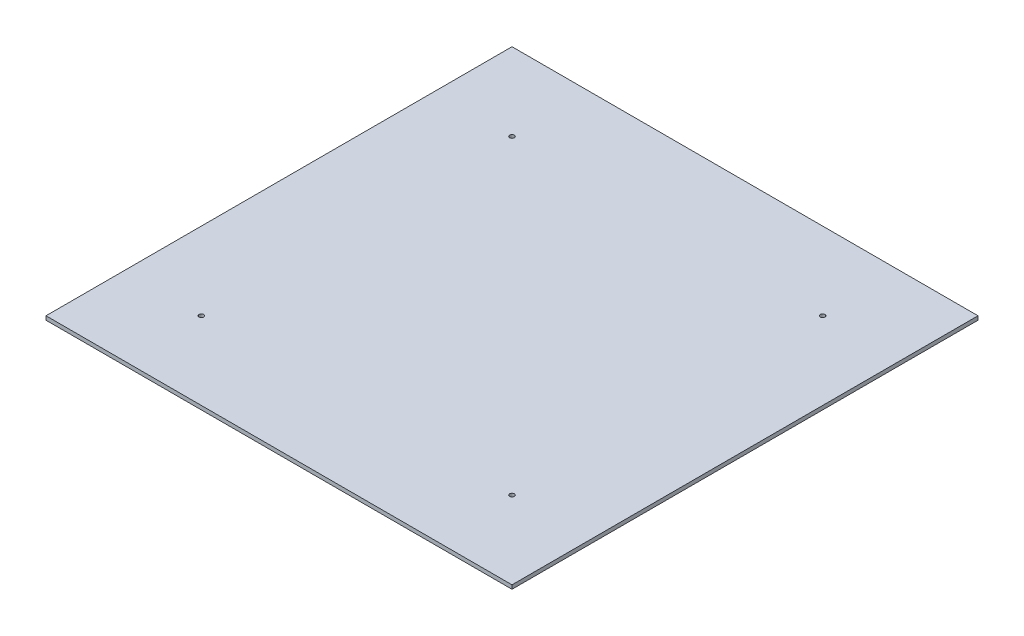
ISO-10303-21;
HEADER;
FILE_DESCRIPTION(('STEP AP214'),'2;1');
FILE_NAME('part.step','',(''),(''),'','','');
FILE_SCHEMA(('AUTOMOTIVE_DESIGN { 1 0 10303 214 1 1 1 1 }'));
ENDSEC;
DATA;
#1=APPLICATION_CONTEXT('core data for automotive mechanical design processes');
#2=APPLICATION_PROTOCOL_DEFINITION('international standard','automotive_design',2000,#1);
#3=PRODUCT_CONTEXT('',#1,'mechanical');
#4=PRODUCT('Part','Part','',(#3));
#5=PRODUCT_RELATED_PRODUCT_CATEGORY('part','',(#4));
#6=PRODUCT_DEFINITION_FORMATION('','',#4);
#7=PRODUCT_DEFINITION_CONTEXT('part definition',#1,'design');
#8=PRODUCT_DEFINITION('design','',#6,#7);
#9=PRODUCT_DEFINITION_SHAPE('','',#8);
#10=(LENGTH_UNIT() NAMED_UNIT(*) SI_UNIT(.MILLI.,.METRE.));
#11=(NAMED_UNIT(*) PLANE_ANGLE_UNIT() SI_UNIT($,.RADIAN.));
#12=(NAMED_UNIT(*) SI_UNIT($,.STERADIAN.) SOLID_ANGLE_UNIT());
#13=UNCERTAINTY_MEASURE_WITH_UNIT(LENGTH_MEASURE(1.E-05),#10,'distance_accuracy_value','');
#14=(GEOMETRIC_REPRESENTATION_CONTEXT(3) GLOBAL_UNCERTAINTY_ASSIGNED_CONTEXT((#13)) GLOBAL_UNIT_ASSIGNED_CONTEXT((#10,
#11,#12)) REPRESENTATION_CONTEXT('',''));
#15=CARTESIAN_POINT('',(0.,0.,0.));
#16=DIRECTION('',(0.,0.,1.));
#17=DIRECTION('',(1.,0.,0.));
#18=AXIS2_PLACEMENT_3D('',#15,#16,#17);
#19=CARTESIAN_POINT('',(0.,2.5,0.));
#20=DIRECTION('',(0.,1.,0.));
#21=DIRECTION('',(0.,0.,1.));
#22=AXIS2_PLACEMENT_3D('',#19,#20,#21);
#23=PLANE('',#22);
#24=CARTESIAN_POINT('',(-100.,2.5,100.));
#25=DIRECTION('',(0.,1.,0.));
#26=DIRECTION('',(0.,0.,-1.));
#27=AXIS2_PLACEMENT_3D('',#24,#25,#26);
#28=CIRCLE('',#27,1.5);
#29=CARTESIAN_POINT('',(-100.,2.5,98.5000000000001));
#30=VERTEX_POINT('',#29);
#31=EDGE_CURVE('E125',#30,#30,#28,.T.);
#32=ORIENTED_EDGE('',*,*,#31,.F.);
#33=EDGE_LOOP('',(#32));
#34=FACE_BOUND('',#33,.T.);
#35=CARTESIAN_POINT('',(-100.,2.5,-100.));
#36=DIRECTION('',(0.,1.,0.));
#37=DIRECTION('',(0.,0.,1.));
#38=AXIS2_PLACEMENT_3D('',#35,#36,#37);
#39=CIRCLE('',#38,1.5);
#40=CARTESIAN_POINT('',(-100.,2.5,-98.5000000000001));
#41=VERTEX_POINT('',#40);
#42=EDGE_CURVE('E104',#41,#41,#39,.T.);
#43=ORIENTED_EDGE('',*,*,#42,.F.);
#44=EDGE_LOOP('',(#43));
#45=FACE_BOUND('',#44,.T.);
#46=DIRECTION('',(0.,0.,-1.));
#47=VECTOR('',#46,1.);
#48=CARTESIAN_POINT('',(150.,2.5,-150.));
#49=LINE('',#48,#47);
#50=CARTESIAN_POINT('',(150.,2.5,150.));
#51=VERTEX_POINT('',#50);
#52=CARTESIAN_POINT('',(150.,2.5,-150.));
#53=VERTEX_POINT('',#52);
#54=EDGE_CURVE('E89',#51,#53,#49,.T.);
#55=ORIENTED_EDGE('',*,*,#54,.T.);
#56=DIRECTION('',(-1.,0.,0.));
#57=VECTOR('',#56,1.);
#58=CARTESIAN_POINT('',(-150.,2.5,-150.));
#59=LINE('',#58,#57);
#60=CARTESIAN_POINT('',(-150.,2.5,-150.));
#61=VERTEX_POINT('',#60);
#62=EDGE_CURVE('E84',#53,#61,#59,.T.);
#63=ORIENTED_EDGE('',*,*,#62,.T.);
#64=DIRECTION('',(0.,0.,1.));
#65=VECTOR('',#64,1.);
#66=CARTESIAN_POINT('',(-150.,2.5,-150.));
#67=LINE('',#66,#65);
#68=CARTESIAN_POINT('',(-150.,2.5,150.));
#69=VERTEX_POINT('',#68);
#70=EDGE_CURVE('E87',#61,#69,#67,.T.);
#71=ORIENTED_EDGE('',*,*,#70,.T.);
#72=DIRECTION('',(1.,0.,0.));
#73=VECTOR('',#72,1.);
#74=CARTESIAN_POINT('',(-150.,2.5,150.));
#75=LINE('',#74,#73);
#76=EDGE_CURVE('E54',#69,#51,#75,.T.);
#77=ORIENTED_EDGE('',*,*,#76,.T.);
#78=EDGE_LOOP('',(#55,#63,#71,#77));
#79=FACE_BOUND('',#78,.T.);
#80=CARTESIAN_POINT('',(100.,2.5,-100.));
#81=DIRECTION('',(0.,1.,0.));
#82=DIRECTION('',(0.,0.,-1.));
#83=AXIS2_PLACEMENT_3D('',#80,#81,#82);
#84=CIRCLE('',#83,1.5);
#85=CARTESIAN_POINT('',(100.,2.5,-101.5));
#86=VERTEX_POINT('',#85);
#87=EDGE_CURVE('E119',#86,#86,#84,.T.);
#88=ORIENTED_EDGE('',*,*,#87,.F.);
#89=EDGE_LOOP('',(#88));
#90=FACE_BOUND('',#89,.T.);
#91=CARTESIAN_POINT('',(100.,2.5,100.));
#92=DIRECTION('',(0.,1.,0.));
#93=DIRECTION('',(0.,0.,1.));
#94=AXIS2_PLACEMENT_3D('',#91,#92,#93);
#95=CIRCLE('',#94,1.5);
#96=CARTESIAN_POINT('',(100.,2.5,101.5));
#97=VERTEX_POINT('',#96);
#98=EDGE_CURVE('E131',#97,#97,#95,.T.);
#99=ORIENTED_EDGE('',*,*,#98,.F.);
#100=EDGE_LOOP('',(#99));
#101=FACE_BOUND('',#100,.T.);
#102=ADVANCED_FACE('F37',(#34,#45,#79,#90,#101),#23,.T.);
#103=CARTESIAN_POINT('',(0.,0.,0.));
#104=DIRECTION('',(0.,1.,0.));
#105=DIRECTION('',(0.,0.,1.));
#106=AXIS2_PLACEMENT_3D('',#103,#104,#105);
#107=PLANE('',#106);
#108=DIRECTION('',(0.,0.,-1.));
#109=VECTOR('',#108,1.);
#110=CARTESIAN_POINT('',(150.,0.,-150.));
#111=LINE('',#110,#109);
#112=CARTESIAN_POINT('',(150.,0.,150.));
#113=VERTEX_POINT('',#112);
#114=CARTESIAN_POINT('',(150.,0.,-150.));
#115=VERTEX_POINT('',#114);
#116=EDGE_CURVE('E101',#113,#115,#111,.T.);
#117=ORIENTED_EDGE('',*,*,#116,.F.);
#118=DIRECTION('',(1.,0.,0.));
#119=VECTOR('',#118,1.);
#120=CARTESIAN_POINT('',(-150.,0.,150.));
#121=LINE('',#120,#119);
#122=CARTESIAN_POINT('',(-150.,0.,150.));
#123=VERTEX_POINT('',#122);
#124=EDGE_CURVE('E77',#123,#113,#121,.T.);
#125=ORIENTED_EDGE('',*,*,#124,.F.);
#126=DIRECTION('',(0.,0.,1.));
#127=VECTOR('',#126,1.);
#128=CARTESIAN_POINT('',(-150.,0.,-150.));
#129=LINE('',#128,#127);
#130=CARTESIAN_POINT('',(-150.,0.,-150.));
#131=VERTEX_POINT('',#130);
#132=EDGE_CURVE('E71',#131,#123,#129,.T.);
#133=ORIENTED_EDGE('',*,*,#132,.F.);
#134=DIRECTION('',(-1.,0.,0.));
#135=VECTOR('',#134,1.);
#136=CARTESIAN_POINT('',(-150.,0.,-150.));
#137=LINE('',#136,#135);
#138=EDGE_CURVE('E93',#115,#131,#137,.T.);
#139=ORIENTED_EDGE('',*,*,#138,.F.);
#140=EDGE_LOOP('',(#117,#125,#133,#139));
#141=FACE_BOUND('',#140,.T.);
#142=CARTESIAN_POINT('',(-100.,0.,-100.));
#143=DIRECTION('',(0.,1.,0.));
#144=DIRECTION('',(0.,0.,1.));
#145=AXIS2_PLACEMENT_3D('',#142,#143,#144);
#146=CIRCLE('',#145,1.5);
#147=CARTESIAN_POINT('',(-100.,0.,-98.5000000000001));
#148=VERTEX_POINT('',#147);
#149=EDGE_CURVE('E116',#148,#148,#146,.T.);
#150=ORIENTED_EDGE('',*,*,#149,.T.);
#151=EDGE_LOOP('',(#150));
#152=FACE_BOUND('',#151,.T.);
#153=CARTESIAN_POINT('',(100.,0.,-100.));
#154=DIRECTION('',(0.,1.,0.));
#155=DIRECTION('',(0.,0.,-1.));
#156=AXIS2_PLACEMENT_3D('',#153,#154,#155);
#157=CIRCLE('',#156,1.5);
#158=CARTESIAN_POINT('',(100.,0.,-101.5));
#159=VERTEX_POINT('',#158);
#160=EDGE_CURVE('E122',#159,#159,#157,.T.);
#161=ORIENTED_EDGE('',*,*,#160,.T.);
#162=EDGE_LOOP('',(#161));
#163=FACE_BOUND('',#162,.T.);
#164=CARTESIAN_POINT('',(-100.,0.,100.));
#165=DIRECTION('',(0.,1.,0.));
#166=DIRECTION('',(0.,0.,-1.));
#167=AXIS2_PLACEMENT_3D('',#164,#165,#166);
#168=CIRCLE('',#167,1.5);
#169=CARTESIAN_POINT('',(-100.,0.,98.5000000000001));
#170=VERTEX_POINT('',#169);
#171=EDGE_CURVE('E128',#170,#170,#168,.T.);
#172=ORIENTED_EDGE('',*,*,#171,.T.);
#173=EDGE_LOOP('',(#172));
#174=FACE_BOUND('',#173,.T.);
#175=CARTESIAN_POINT('',(100.,0.,100.));
#176=DIRECTION('',(0.,1.,0.));
#177=DIRECTION('',(0.,0.,1.));
#178=AXIS2_PLACEMENT_3D('',#175,#176,#177);
#179=CIRCLE('',#178,1.5);
#180=CARTESIAN_POINT('',(100.,0.,101.5));
#181=VERTEX_POINT('',#180);
#182=EDGE_CURVE('E134',#181,#181,#179,.T.);
#183=ORIENTED_EDGE('',*,*,#182,.T.);
#184=EDGE_LOOP('',(#183));
#185=FACE_BOUND('',#184,.T.);
#186=ADVANCED_FACE('F112',(#141,#152,#163,#174,#185),#107,.F.);
#187=CARTESIAN_POINT('',(150.,2.5,-150.));
#188=DIRECTION('',(-1.,0.,0.));
#189=DIRECTION('',(0.,0.,1.));
#190=AXIS2_PLACEMENT_3D('',#187,#188,#189);
#191=PLANE('',#190);
#192=ORIENTED_EDGE('',*,*,#116,.T.);
#193=DIRECTION('',(0.,-1.,0.));
#194=VECTOR('',#193,1.);
#195=CARTESIAN_POINT('',(150.,2.5,-150.));
#196=LINE('',#195,#194);
#197=EDGE_CURVE('E11',#53,#115,#196,.T.);
#198=ORIENTED_EDGE('',*,*,#197,.F.);
#199=ORIENTED_EDGE('',*,*,#54,.F.);
#200=DIRECTION('',(0.,-1.,0.));
#201=VECTOR('',#200,1.);
#202=CARTESIAN_POINT('',(150.,2.5,150.));
#203=LINE('',#202,#201);
#204=EDGE_CURVE('E97',#51,#113,#203,.T.);
#205=ORIENTED_EDGE('',*,*,#204,.T.);
#206=EDGE_LOOP('',(#192,#198,#199,#205));
#207=FACE_BOUND('',#206,.T.);
#208=ADVANCED_FACE('F39',(#207),#191,.F.);
#209=CARTESIAN_POINT('',(-150.,2.5,-150.));
#210=DIRECTION('',(0.,0.,1.));
#211=DIRECTION('',(1.,0.,0.));
#212=AXIS2_PLACEMENT_3D('',#209,#210,#211);
#213=PLANE('',#212);
#214=ORIENTED_EDGE('',*,*,#138,.T.);
#215=DIRECTION('',(0.,-1.,0.));
#216=VECTOR('',#215,1.);
#217=CARTESIAN_POINT('',(-150.,2.5,-150.));
#218=LINE('',#217,#216);
#219=EDGE_CURVE('E46',#61,#131,#218,.T.);
#220=ORIENTED_EDGE('',*,*,#219,.F.);
#221=ORIENTED_EDGE('',*,*,#62,.F.);
#222=ORIENTED_EDGE('',*,*,#197,.T.);
#223=EDGE_LOOP('',(#214,#220,#221,#222));
#224=FACE_BOUND('',#223,.T.);
#225=ADVANCED_FACE('F92',(#224),#213,.F.);
#226=CARTESIAN_POINT('',(-150.,2.5,-150.));
#227=DIRECTION('',(1.,0.,0.));
#228=DIRECTION('',(0.,0.,-1.));
#229=AXIS2_PLACEMENT_3D('',#226,#227,#228);
#230=PLANE('',#229);
#231=ORIENTED_EDGE('',*,*,#132,.T.);
#232=DIRECTION('',(0.,-1.,0.));
#233=VECTOR('',#232,1.);
#234=CARTESIAN_POINT('',(-150.,2.5,150.));
#235=LINE('',#234,#233);
#236=EDGE_CURVE('E94',#69,#123,#235,.T.);
#237=ORIENTED_EDGE('',*,*,#236,.F.);
#238=ORIENTED_EDGE('',*,*,#70,.F.);
#239=ORIENTED_EDGE('',*,*,#219,.T.);
#240=EDGE_LOOP('',(#231,#237,#238,#239));
#241=FACE_BOUND('',#240,.T.);
#242=ADVANCED_FACE('F95',(#241),#230,.F.);
#243=CARTESIAN_POINT('',(-150.,2.5,150.));
#244=DIRECTION('',(0.,0.,-1.));
#245=DIRECTION('',(-1.,0.,0.));
#246=AXIS2_PLACEMENT_3D('',#243,#244,#245);
#247=PLANE('',#246);
#248=ORIENTED_EDGE('',*,*,#124,.T.);
#249=ORIENTED_EDGE('',*,*,#204,.F.);
#250=ORIENTED_EDGE('',*,*,#76,.F.);
#251=ORIENTED_EDGE('',*,*,#236,.T.);
#252=EDGE_LOOP('',(#248,#249,#250,#251));
#253=FACE_BOUND('',#252,.T.);
#254=ADVANCED_FACE('F109',(#253),#247,.F.);
#255=CARTESIAN_POINT('',(-100.,2.5,-100.));
#256=DIRECTION('',(0.,-1.,0.));
#257=DIRECTION('',(0.,0.,-1.));
#258=AXIS2_PLACEMENT_3D('',#255,#256,#257);
#259=CYLINDRICAL_SURFACE('',#258,1.5);
#260=ORIENTED_EDGE('',*,*,#42,.T.);
#261=EDGE_LOOP('',(#260));
#262=FACE_BOUND('',#261,.T.);
#263=ORIENTED_EDGE('',*,*,#149,.F.);
#264=EDGE_LOOP('',(#263));
#265=FACE_BOUND('',#264,.T.);
#266=ADVANCED_FACE('F153',(#262,#265),#259,.F.);
#267=CARTESIAN_POINT('',(100.,2.5,-100.));
#268=DIRECTION('',(0.,-1.,0.));
#269=DIRECTION('',(0.,0.,-1.));
#270=AXIS2_PLACEMENT_3D('',#267,#268,#269);
#271=CYLINDRICAL_SURFACE('',#270,1.5);
#272=ORIENTED_EDGE('',*,*,#87,.T.);
#273=EDGE_LOOP('',(#272));
#274=FACE_BOUND('',#273,.T.);
#275=ORIENTED_EDGE('',*,*,#160,.F.);
#276=EDGE_LOOP('',(#275));
#277=FACE_BOUND('',#276,.T.);
#278=ADVANCED_FACE('F207',(#274,#277),#271,.F.);
#279=CARTESIAN_POINT('',(-100.,2.5,100.));
#280=DIRECTION('',(0.,-1.,0.));
#281=DIRECTION('',(0.,0.,-1.));
#282=AXIS2_PLACEMENT_3D('',#279,#280,#281);
#283=CYLINDRICAL_SURFACE('',#282,1.5);
#284=ORIENTED_EDGE('',*,*,#31,.T.);
#285=EDGE_LOOP('',(#284));
#286=FACE_BOUND('',#285,.T.);
#287=ORIENTED_EDGE('',*,*,#171,.F.);
#288=EDGE_LOOP('',(#287));
#289=FACE_BOUND('',#288,.T.);
#290=ADVANCED_FACE('F216',(#286,#289),#283,.F.);
#291=CARTESIAN_POINT('',(100.,2.5,100.));
#292=DIRECTION('',(0.,-1.,0.));
#293=DIRECTION('',(0.,0.,-1.));
#294=AXIS2_PLACEMENT_3D('',#291,#292,#293);
#295=CYLINDRICAL_SURFACE('',#294,1.5);
#296=ORIENTED_EDGE('',*,*,#98,.T.);
#297=EDGE_LOOP('',(#296));
#298=FACE_BOUND('',#297,.T.);
#299=ORIENTED_EDGE('',*,*,#182,.F.);
#300=EDGE_LOOP('',(#299));
#301=FACE_BOUND('',#300,.T.);
#302=ADVANCED_FACE('F140',(#298,#301),#295,.F.);
#303=CLOSED_SHELL('',(#102,#186,#208,#225,#242,#254,#266,#278,#290,#302));
#304=MANIFOLD_SOLID_BREP('B2',#303);
#305=ADVANCED_BREP_SHAPE_REPRESENTATION('',(#18,#304),#14);
#306=SHAPE_DEFINITION_REPRESENTATION(#9,#305);
ENDSEC;
END-ISO-10303-21;
